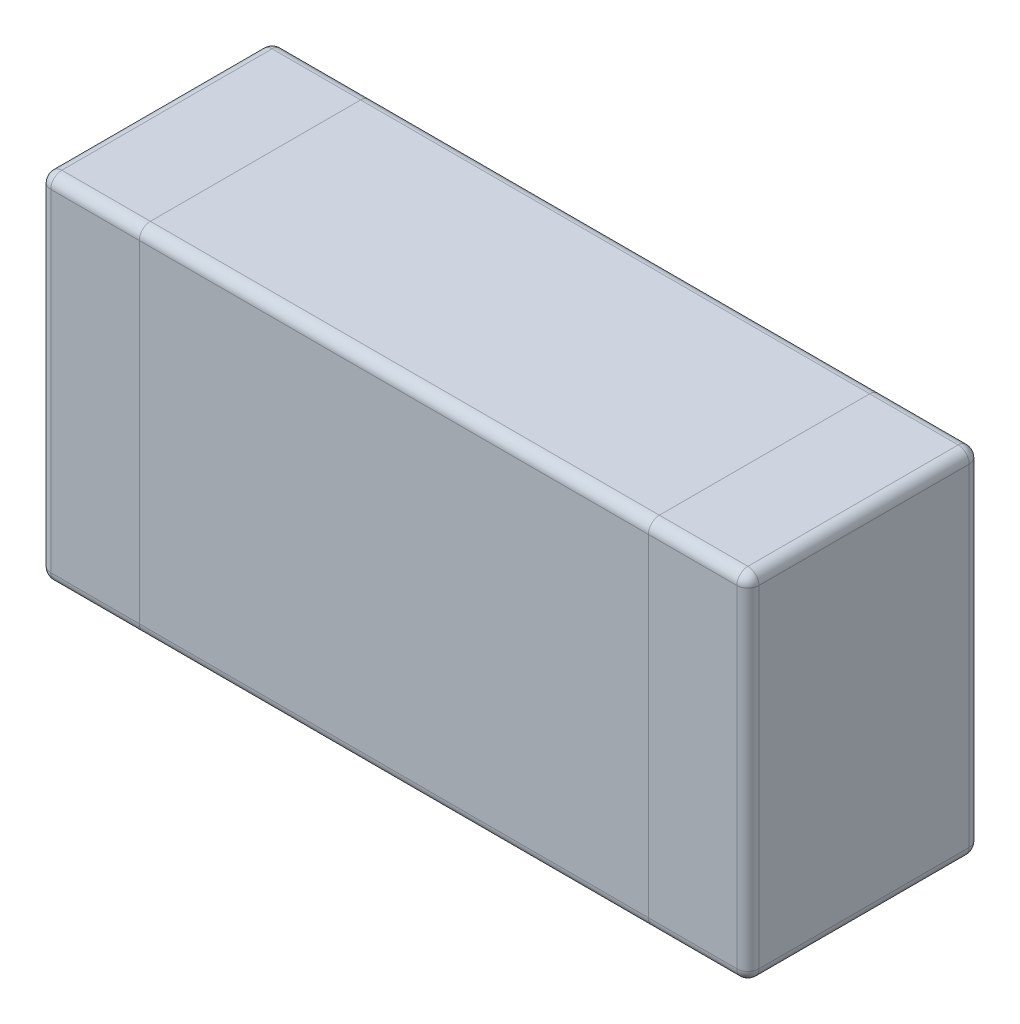
ISO-10303-21;
HEADER;
FILE_DESCRIPTION(('STEP AP214'),'2;1');
FILE_NAME('part.step','',(''),(''),'','','');
FILE_SCHEMA(('AUTOMOTIVE_DESIGN { 1 0 10303 214 1 1 1 1 }'));
ENDSEC;
DATA;
#1=APPLICATION_CONTEXT('core data for automotive mechanical design processes');
#2=APPLICATION_PROTOCOL_DEFINITION('international standard','automotive_design',2000,#1);
#3=PRODUCT_CONTEXT('',#1,'mechanical');
#4=PRODUCT('Part','Part','',(#3));
#5=PRODUCT_RELATED_PRODUCT_CATEGORY('part','',(#4));
#6=PRODUCT_DEFINITION_FORMATION('','',#4);
#7=PRODUCT_DEFINITION_CONTEXT('part definition',#1,'design');
#8=PRODUCT_DEFINITION('design','',#6,#7);
#9=PRODUCT_DEFINITION_SHAPE('','',#8);
#10=(LENGTH_UNIT() NAMED_UNIT(*) SI_UNIT(.MILLI.,.METRE.));
#11=(NAMED_UNIT(*) PLANE_ANGLE_UNIT() SI_UNIT($,.RADIAN.));
#12=(NAMED_UNIT(*) SI_UNIT($,.STERADIAN.) SOLID_ANGLE_UNIT());
#13=UNCERTAINTY_MEASURE_WITH_UNIT(LENGTH_MEASURE(1.E-05),#10,'distance_accuracy_value','');
#14=(GEOMETRIC_REPRESENTATION_CONTEXT(3) GLOBAL_UNCERTAINTY_ASSIGNED_CONTEXT((#13)) GLOBAL_UNIT_ASSIGNED_CONTEXT((#10,
#11,#12)) REPRESENTATION_CONTEXT('',''));
#15=CARTESIAN_POINT('',(0.,0.,0.));
#16=DIRECTION('',(0.,0.,1.));
#17=DIRECTION('',(1.,0.,0.));
#18=AXIS2_PLACEMENT_3D('',#15,#16,#17);
#19=CARTESIAN_POINT('',(1.55,0.749999999999718,1.0500000000002));
#20=DIRECTION('',(0.,2.68882138776405E-13,-1.));
#21=DIRECTION('',(0.,1.,2.68882138776405E-13));
#22=AXIS2_PLACEMENT_3D('',#19,#20,#21);
#23=CYLINDRICAL_SURFACE('',#22,0.05);
#24=CARTESIAN_POINT('',(1.55,0.749999999999731,1.0000000000002));
#25=DIRECTION('',(0.,2.68882138776405E-13,-1.));
#26=DIRECTION('',(0.,-1.,-2.68882138776405E-13));
#27=AXIS2_PLACEMENT_3D('',#24,#25,#26);
#28=CIRCLE('',#27,0.05);
#29=CARTESIAN_POINT('',(1.55,0.799999999999731,1.00000000000021));
#30=VERTEX_POINT('',#29);
#31=CARTESIAN_POINT('',(1.6,0.749999999999731,1.0000000000002));
#32=VERTEX_POINT('',#31);
#33=EDGE_CURVE('E27',#30,#32,#28,.T.);
#34=ORIENTED_EDGE('',*,*,#33,.T.);
#35=DIRECTION('',(0.,-2.68736422004423E-13,1.));
#36=VECTOR('',#35,1.);
#37=CARTESIAN_POINT('',(1.6,0.749999999999718,1.0500000000002));
#38=LINE('',#37,#36);
#39=CARTESIAN_POINT('',(1.6,0.749999999999987,0.0500000000002015));
#40=VERTEX_POINT('',#39);
#41=EDGE_CURVE('E329',#40,#32,#38,.T.);
#42=ORIENTED_EDGE('',*,*,#41,.F.);
#43=CARTESIAN_POINT('',(1.55,0.749999999999987,0.0500000000002015));
#44=DIRECTION('',(0.,-2.68746613504845E-13,1.));
#45=DIRECTION('',(0.,1.,2.68746613504845E-13));
#46=AXIS2_PLACEMENT_3D('',#43,#44,#45);
#47=CIRCLE('',#46,0.05);
#48=CARTESIAN_POINT('',(1.55,0.799999999999987,0.0500000000002149));
#49=VERTEX_POINT('',#48);
#50=EDGE_CURVE('E11',#40,#49,#47,.T.);
#51=ORIENTED_EDGE('',*,*,#50,.T.);
#52=DIRECTION('',(0.,2.68736422004423E-13,-1.));
#53=VECTOR('',#52,1.);
#54=CARTESIAN_POINT('',(1.55,0.799999999999718,1.05000000000021));
#55=LINE('',#54,#53);
#56=EDGE_CURVE('E324',#30,#49,#55,.T.);
#57=ORIENTED_EDGE('',*,*,#56,.F.);
#58=EDGE_LOOP('',(#34,#42,#51,#57));
#59=FACE_BOUND('',#58,.T.);
#60=ADVANCED_FACE('F17',(#59),#23,.T.);
#61=CARTESIAN_POINT('',(1.55,0.749999999999987,0.0500000000002016));
#62=DIRECTION('',(0.,-2.68736422004423E-13,1.));
#63=DIRECTION('',(1.,0.,0.));
#64=AXIS2_PLACEMENT_3D('',#61,#62,#63);
#65=SPHERICAL_SURFACE('',#64,0.05);
#66=CARTESIAN_POINT('',(1.55,0.749999999999987,0.0500000000002015));
#67=DIRECTION('',(0.,1.,2.68736422004423E-13));
#68=DIRECTION('',(-1.,0.,0.));
#69=AXIS2_PLACEMENT_3D('',#66,#67,#68);
#70=CIRCLE('',#69,0.05);
#71=CARTESIAN_POINT('',(1.55,0.75,2.01552316503317E-13));
#72=VERTEX_POINT('',#71);
#73=EDGE_CURVE('E254',#40,#72,#70,.T.);
#74=ORIENTED_EDGE('',*,*,#73,.T.);
#75=CARTESIAN_POINT('',(1.55,0.749999999999987,0.0500000000002016));
#76=DIRECTION('',(1.,0.,0.));
#77=DIRECTION('',(0.,1.,2.68746613504845E-13));
#78=AXIS2_PLACEMENT_3D('',#75,#76,#77);
#79=CIRCLE('',#78,0.05);
#80=EDGE_CURVE('E309',#72,#49,#79,.T.);
#81=ORIENTED_EDGE('',*,*,#80,.T.);
#82=ORIENTED_EDGE('',*,*,#50,.F.);
#83=EDGE_LOOP('',(#74,#81,#82));
#84=FACE_BOUND('',#83,.T.);
#85=ADVANCED_FACE('F770',(#84),#65,.T.);
#86=CARTESIAN_POINT('',(1.55,0.749999999999731,1.0000000000002));
#87=DIRECTION('',(0.,-2.68736422004423E-13,1.));
#88=DIRECTION('',(1.,0.,0.));
#89=AXIS2_PLACEMENT_3D('',#86,#87,#88);
#90=SPHERICAL_SURFACE('',#89,0.05);
#91=CARTESIAN_POINT('',(1.55,0.749999999999731,1.0000000000002));
#92=DIRECTION('',(1.,0.,0.));
#93=DIRECTION('',(0.,-2.68882138776406E-13,1.));
#94=AXIS2_PLACEMENT_3D('',#91,#92,#93);
#95=CIRCLE('',#94,0.05);
#96=CARTESIAN_POINT('',(1.55,0.749999999999718,1.0500000000002));
#97=VERTEX_POINT('',#96);
#98=EDGE_CURVE('E294',#30,#97,#95,.T.);
#99=ORIENTED_EDGE('',*,*,#98,.T.);
#100=CARTESIAN_POINT('',(1.55,0.749999999999731,1.0000000000002));
#101=DIRECTION('',(0.,1.,2.68736422004423E-13));
#102=DIRECTION('',(-1.,0.,0.));
#103=AXIS2_PLACEMENT_3D('',#100,#101,#102);
#104=CIRCLE('',#103,0.05);
#105=EDGE_CURVE('E20',#97,#32,#104,.T.);
#106=ORIENTED_EDGE('',*,*,#105,.T.);
#107=ORIENTED_EDGE('',*,*,#33,.F.);
#108=EDGE_LOOP('',(#99,#106,#107));
#109=FACE_BOUND('',#108,.T.);
#110=ADVANCED_FACE('F775',(#109),#90,.T.);
#111=CARTESIAN_POINT('',(1.55,-0.800000000000014,0.0499999999997849));
#112=DIRECTION('',(0.,-1.,-2.68736422004423E-13));
#113=DIRECTION('',(1.,0.,0.));
#114=AXIS2_PLACEMENT_3D('',#111,#112,#113);
#115=CYLINDRICAL_SURFACE('',#114,0.05);
#116=CARTESIAN_POINT('',(1.55,-0.750000000000014,0.0499999999997985));
#117=DIRECTION('',(0.,1.,2.68736422004423E-13));
#118=DIRECTION('',(1.,0.,0.));
#119=AXIS2_PLACEMENT_3D('',#116,#117,#118);
#120=CIRCLE('',#119,0.05);
#121=CARTESIAN_POINT('',(1.6,-0.750000000000014,0.0499999999997984));
#122=VERTEX_POINT('',#121);
#123=CARTESIAN_POINT('',(1.55,-0.75,-2.01552316503317E-13));
#124=VERTEX_POINT('',#123);
#125=EDGE_CURVE('E173',#122,#124,#120,.T.);
#126=ORIENTED_EDGE('',*,*,#125,.T.);
#127=DIRECTION('',(0.,-1.,-2.68736422004423E-13));
#128=VECTOR('',#127,1.);
#129=CARTESIAN_POINT('',(1.55,-0.8,-2.14989137603538E-13));
#130=LINE('',#129,#128);
#131=EDGE_CURVE('E285',#72,#124,#130,.T.);
#132=ORIENTED_EDGE('',*,*,#131,.F.);
#133=ORIENTED_EDGE('',*,*,#73,.F.);
#134=DIRECTION('',(0.,1.,2.68736422004423E-13));
#135=VECTOR('',#134,1.);
#136=CARTESIAN_POINT('',(1.6,0.799999999999987,0.0500000000002149));
#137=LINE('',#136,#135);
#138=EDGE_CURVE('E334',#122,#40,#137,.T.);
#139=ORIENTED_EDGE('',*,*,#138,.F.);
#140=EDGE_LOOP('',(#126,#132,#133,#139));
#141=FACE_BOUND('',#140,.T.);
#142=ADVANCED_FACE('F779',(#141),#115,.T.);
#143=CARTESIAN_POINT('',(-1.6,0.749999999999987,0.0500000000002015));
#144=DIRECTION('',(1.,0.,0.));
#145=DIRECTION('',(0.,1.,2.68746613504845E-13));
#146=AXIS2_PLACEMENT_3D('',#143,#144,#145);
#147=CYLINDRICAL_SURFACE('',#146,0.05);
#148=CARTESIAN_POINT('',(-1.15,0.749999999999987,0.0500000000002015));
#149=DIRECTION('',(-1.,0.,0.));
#150=DIRECTION('',(0.,1.,2.68746613504845E-13));
#151=AXIS2_PLACEMENT_3D('',#148,#149,#150);
#152=CIRCLE('',#151,0.05);
#153=CARTESIAN_POINT('',(-1.15,0.799999999999987,0.0500000000002149));
#154=VERTEX_POINT('',#153);
#155=CARTESIAN_POINT('',(-1.15,0.75,2.01552316503317E-13));
#156=VERTEX_POINT('',#155);
#157=EDGE_CURVE('E302',#154,#156,#152,.T.);
#158=ORIENTED_EDGE('',*,*,#157,.F.);
#159=DIRECTION('',(-1.,0.,0.));
#160=VECTOR('',#159,1.);
#161=CARTESIAN_POINT('',(-1.6,0.799999999999987,0.0500000000002149));
#162=LINE('',#161,#160);
#163=CARTESIAN_POINT('',(1.15,0.799999999999987,0.0500000000002149));
#164=VERTEX_POINT('',#163);
#165=EDGE_CURVE('E130',#164,#154,#162,.T.);
#166=ORIENTED_EDGE('',*,*,#165,.F.);
#167=CARTESIAN_POINT('',(1.15,0.749999999999987,0.0500000000002015));
#168=DIRECTION('',(1.,0.,0.));
#169=DIRECTION('',(0.,-1.,-2.68746613504845E-13));
#170=AXIS2_PLACEMENT_3D('',#167,#168,#169);
#171=CIRCLE('',#170,0.05);
#172=CARTESIAN_POINT('',(1.15,0.75,2.01552316503317E-13));
#173=VERTEX_POINT('',#172);
#174=EDGE_CURVE('E238',#173,#164,#171,.T.);
#175=ORIENTED_EDGE('',*,*,#174,.F.);
#176=DIRECTION('',(1.,0.,0.));
#177=VECTOR('',#176,1.);
#178=CARTESIAN_POINT('',(1.6,0.75,2.01552316503317E-13));
#179=LINE('',#178,#177);
#180=EDGE_CURVE('E155',#156,#173,#179,.T.);
#181=ORIENTED_EDGE('',*,*,#180,.F.);
#182=EDGE_LOOP('',(#158,#166,#175,#181));
#183=FACE_BOUND('',#182,.T.);
#184=ADVANCED_FACE('F526',(#183),#147,.T.);
#185=CARTESIAN_POINT('',(1.6,0.749999999999731,1.0000000000002));
#186=DIRECTION('',(-1.,0.,0.));
#187=DIRECTION('',(0.,-1.,-2.68882138776405E-13));
#188=AXIS2_PLACEMENT_3D('',#185,#186,#187);
#189=CYLINDRICAL_SURFACE('',#188,0.05);
#190=CARTESIAN_POINT('',(-1.15,0.749999999999731,1.0000000000002));
#191=DIRECTION('',(-1.,0.,0.));
#192=DIRECTION('',(0.,1.,2.68882138776405E-13));
#193=AXIS2_PLACEMENT_3D('',#190,#191,#192);
#194=CIRCLE('',#193,0.05);
#195=CARTESIAN_POINT('',(-1.15,0.749999999999718,1.0500000000002));
#196=VERTEX_POINT('',#195);
#197=CARTESIAN_POINT('',(-1.15,0.799999999999731,1.00000000000021));
#198=VERTEX_POINT('',#197);
#199=EDGE_CURVE('E289',#196,#198,#194,.T.);
#200=ORIENTED_EDGE('',*,*,#199,.F.);
#201=DIRECTION('',(-1.,0.,0.));
#202=VECTOR('',#201,1.);
#203=CARTESIAN_POINT('',(1.6,0.749999999999718,1.0500000000002));
#204=LINE('',#203,#202);
#205=CARTESIAN_POINT('',(1.15,0.749999999999718,1.0500000000002));
#206=VERTEX_POINT('',#205);
#207=EDGE_CURVE('E150',#206,#196,#204,.T.);
#208=ORIENTED_EDGE('',*,*,#207,.F.);
#209=CARTESIAN_POINT('',(1.15,0.749999999999731,1.0000000000002));
#210=DIRECTION('',(1.,0.,0.));
#211=DIRECTION('',(0.,-1.,-2.68882138776405E-13));
#212=AXIS2_PLACEMENT_3D('',#209,#210,#211);
#213=CIRCLE('',#212,0.05);
#214=CARTESIAN_POINT('',(1.15,0.799999999999731,1.00000000000021));
#215=VERTEX_POINT('',#214);
#216=EDGE_CURVE('E290',#215,#206,#213,.T.);
#217=ORIENTED_EDGE('',*,*,#216,.F.);
#218=DIRECTION('',(1.,0.,0.));
#219=VECTOR('',#218,1.);
#220=CARTESIAN_POINT('',(-1.6,0.799999999999731,1.00000000000021));
#221=LINE('',#220,#219);
#222=EDGE_CURVE('E123',#198,#215,#221,.T.);
#223=ORIENTED_EDGE('',*,*,#222,.F.);
#224=EDGE_LOOP('',(#200,#208,#217,#223));
#225=FACE_BOUND('',#224,.T.);
#226=ADVANCED_FACE('F786',(#225),#189,.T.);
#227=CARTESIAN_POINT('',(1.55,0.799999999999731,1.00000000000021));
#228=DIRECTION('',(0.,1.,2.68736422004423E-13));
#229=DIRECTION('',(-1.,0.,0.));
#230=AXIS2_PLACEMENT_3D('',#227,#228,#229);
#231=CYLINDRICAL_SURFACE('',#230,0.05);
#232=CARTESIAN_POINT('',(1.55,-0.750000000000269,0.999999999999799));
#233=DIRECTION('',(0.,1.,2.71050543121376E-13));
#234=DIRECTION('',(0.,2.71050543121376E-13,-1.));
#235=AXIS2_PLACEMENT_3D('',#232,#233,#234);
#236=CIRCLE('',#235,0.05);
#237=CARTESIAN_POINT('',(1.55,-0.750000000000283,1.0499999999998));
#238=VERTEX_POINT('',#237);
#239=CARTESIAN_POINT('',(1.6,-0.750000000000269,0.999999999999799));
#240=VERTEX_POINT('',#239);
#241=EDGE_CURVE('E169',#238,#240,#236,.T.);
#242=ORIENTED_EDGE('',*,*,#241,.T.);
#243=DIRECTION('',(0.,-1.,-2.68736422004423E-13));
#244=VECTOR('',#243,1.);
#245=CARTESIAN_POINT('',(1.6,-0.800000000000269,0.999999999999786));
#246=LINE('',#245,#244);
#247=EDGE_CURVE('E330',#32,#240,#246,.T.);
#248=ORIENTED_EDGE('',*,*,#247,.F.);
#249=ORIENTED_EDGE('',*,*,#105,.F.);
#250=DIRECTION('',(0.,1.,2.68736422004423E-13));
#251=VECTOR('',#250,1.);
#252=CARTESIAN_POINT('',(1.55,0.799999999999718,1.05000000000021));
#253=LINE('',#252,#251);
#254=EDGE_CURVE('E371',#238,#97,#253,.T.);
#255=ORIENTED_EDGE('',*,*,#254,.F.);
#256=EDGE_LOOP('',(#242,#248,#249,#255));
#257=FACE_BOUND('',#256,.T.);
#258=ADVANCED_FACE('F570',(#257),#231,.T.);
#259=CARTESIAN_POINT('',(1.55,-0.750000000000014,0.0499999999997985));
#260=DIRECTION('',(0.,-2.68736422004423E-13,1.));
#261=DIRECTION('',(1.,0.,0.));
#262=AXIS2_PLACEMENT_3D('',#259,#260,#261);
#263=SPHERICAL_SURFACE('',#262,0.05);
#264=CARTESIAN_POINT('',(1.55,-0.750000000000014,0.0499999999997984));
#265=DIRECTION('',(0.,2.68746613504845E-13,-1.));
#266=DIRECTION('',(0.,1.,2.68746613504845E-13));
#267=AXIS2_PLACEMENT_3D('',#264,#265,#266);
#268=CIRCLE('',#267,0.05);
#269=CARTESIAN_POINT('',(1.55,-0.800000000000014,0.0499999999997849));
#270=VERTEX_POINT('',#269);
#271=EDGE_CURVE('E174',#122,#270,#268,.T.);
#272=ORIENTED_EDGE('',*,*,#271,.T.);
#273=CARTESIAN_POINT('',(1.55,-0.750000000000014,0.0499999999997984));
#274=DIRECTION('',(1.,0.,0.));
#275=DIRECTION('',(0.,1.,2.68746613504845E-13));
#276=AXIS2_PLACEMENT_3D('',#273,#274,#275);
#277=CIRCLE('',#276,0.05);
#278=EDGE_CURVE('E190',#270,#124,#277,.T.);
#279=ORIENTED_EDGE('',*,*,#278,.T.);
#280=ORIENTED_EDGE('',*,*,#125,.F.);
#281=EDGE_LOOP('',(#272,#279,#280));
#282=FACE_BOUND('',#281,.T.);
#283=ADVANCED_FACE('F188',(#282),#263,.T.);
#284=CARTESIAN_POINT('',(-1.55,0.749999999999987,0.0500000000002016));
#285=DIRECTION('',(0.,-2.68736422004423E-13,1.));
#286=DIRECTION('',(1.,0.,0.));
#287=AXIS2_PLACEMENT_3D('',#284,#285,#286);
#288=SPHERICAL_SURFACE('',#287,0.05);
#289=CARTESIAN_POINT('',(-1.55,0.749999999999987,0.0500000000002016));
#290=DIRECTION('',(0.,1.,2.68736422004423E-13));
#291=DIRECTION('',(-1.,0.,0.));
#292=AXIS2_PLACEMENT_3D('',#289,#290,#291);
#293=CIRCLE('',#292,0.05);
#294=CARTESIAN_POINT('',(-1.55,0.75,2.01552316503317E-13));
#295=VERTEX_POINT('',#294);
#296=CARTESIAN_POINT('',(-1.6,0.749999999999987,0.0500000000002015));
#297=VERTEX_POINT('',#296);
#298=EDGE_CURVE('E41',#295,#297,#293,.T.);
#299=ORIENTED_EDGE('',*,*,#298,.T.);
#300=CARTESIAN_POINT('',(-1.55,0.749999999999987,0.0500000000002015));
#301=DIRECTION('',(0.,2.68746613504845E-13,-1.));
#302=DIRECTION('',(0.,1.,2.68746613504845E-13));
#303=AXIS2_PLACEMENT_3D('',#300,#301,#302);
#304=CIRCLE('',#303,0.05);
#305=CARTESIAN_POINT('',(-1.55,0.799999999999987,0.0500000000002149));
#306=VERTEX_POINT('',#305);
#307=EDGE_CURVE('E134',#297,#306,#304,.T.);
#308=ORIENTED_EDGE('',*,*,#307,.T.);
#309=CARTESIAN_POINT('',(-1.55,0.749999999999987,0.0500000000002015));
#310=DIRECTION('',(1.,0.,0.));
#311=DIRECTION('',(0.,-1.,-2.68746613504845E-13));
#312=AXIS2_PLACEMENT_3D('',#309,#310,#311);
#313=CIRCLE('',#312,0.05);
#314=EDGE_CURVE('E242',#295,#306,#313,.T.);
#315=ORIENTED_EDGE('',*,*,#314,.F.);
#316=EDGE_LOOP('',(#299,#308,#315));
#317=FACE_BOUND('',#316,.T.);
#318=ADVANCED_FACE('F513',(#317),#288,.T.);
#319=CARTESIAN_POINT('',(-1.55,0.749999999999731,1.0000000000002));
#320=DIRECTION('',(0.,-2.68736422004423E-13,1.));
#321=DIRECTION('',(1.,0.,0.));
#322=AXIS2_PLACEMENT_3D('',#319,#320,#321);
#323=SPHERICAL_SURFACE('',#322,0.05);
#324=CARTESIAN_POINT('',(-1.55,0.749999999999731,1.0000000000002));
#325=DIRECTION('',(0.,-2.68882138776405E-13,1.));
#326=DIRECTION('',(0.,-1.,-2.68882138776405E-13));
#327=AXIS2_PLACEMENT_3D('',#324,#325,#326);
#328=CIRCLE('',#327,0.05);
#329=CARTESIAN_POINT('',(-1.55,0.799999999999731,1.00000000000021));
#330=VERTEX_POINT('',#329);
#331=CARTESIAN_POINT('',(-1.6,0.749999999999732,1.0000000000002));
#332=VERTEX_POINT('',#331);
#333=EDGE_CURVE('E136',#330,#332,#328,.T.);
#334=ORIENTED_EDGE('',*,*,#333,.T.);
#335=CARTESIAN_POINT('',(-1.55,0.749999999999732,1.0000000000002));
#336=DIRECTION('',(0.,1.,2.71050543121376E-13));
#337=DIRECTION('',(0.,-2.71050543121376E-13,1.));
#338=AXIS2_PLACEMENT_3D('',#335,#336,#337);
#339=CIRCLE('',#338,0.05);
#340=CARTESIAN_POINT('',(-1.55,0.749999999999718,1.0500000000002));
#341=VERTEX_POINT('',#340);
#342=EDGE_CURVE('E111',#332,#341,#339,.T.);
#343=ORIENTED_EDGE('',*,*,#342,.T.);
#344=CARTESIAN_POINT('',(-1.55,0.749999999999731,1.0000000000002));
#345=DIRECTION('',(1.,0.,0.));
#346=DIRECTION('',(0.,-1.,-2.68882138776405E-13));
#347=AXIS2_PLACEMENT_3D('',#344,#345,#346);
#348=CIRCLE('',#347,0.05);
#349=EDGE_CURVE('E262',#330,#341,#348,.T.);
#350=ORIENTED_EDGE('',*,*,#349,.F.);
#351=EDGE_LOOP('',(#334,#343,#350));
#352=FACE_BOUND('',#351,.T.);
#353=ADVANCED_FACE('F816',(#352),#323,.T.);
#354=CARTESIAN_POINT('',(1.55,-0.750000000000269,0.999999999999799));
#355=DIRECTION('',(0.,-2.68736422004423E-13,1.));
#356=DIRECTION('',(1.,0.,0.));
#357=AXIS2_PLACEMENT_3D('',#354,#355,#356);
#358=SPHERICAL_SURFACE('',#357,0.05);
#359=CARTESIAN_POINT('',(1.55,-0.750000000000269,0.999999999999799));
#360=DIRECTION('',(1.,0.,0.));
#361=DIRECTION('',(0.,1.,2.68882138776405E-13));
#362=AXIS2_PLACEMENT_3D('',#359,#360,#361);
#363=CIRCLE('',#362,0.05);
#364=CARTESIAN_POINT('',(1.55,-0.800000000000269,0.999999999999786));
#365=VERTEX_POINT('',#364);
#366=EDGE_CURVE('E361',#238,#365,#363,.T.);
#367=ORIENTED_EDGE('',*,*,#366,.T.);
#368=CARTESIAN_POINT('',(1.55,-0.750000000000269,0.999999999999799));
#369=DIRECTION('',(0.,-2.68882138776405E-13,1.));
#370=DIRECTION('',(0.,-1.,-2.68882138776405E-13));
#371=AXIS2_PLACEMENT_3D('',#368,#369,#370);
#372=CIRCLE('',#371,0.05);
#373=EDGE_CURVE('E175',#365,#240,#372,.T.);
#374=ORIENTED_EDGE('',*,*,#373,.T.);
#375=ORIENTED_EDGE('',*,*,#241,.F.);
#376=EDGE_LOOP('',(#367,#374,#375));
#377=FACE_BOUND('',#376,.T.);
#378=ADVANCED_FACE('F561',(#377),#358,.T.);
#379=CARTESIAN_POINT('',(1.55,-0.750000000000283,1.0499999999998));
#380=DIRECTION('',(0.,2.68882138776405E-13,-1.));
#381=DIRECTION('',(0.,1.,2.68882138776405E-13));
#382=AXIS2_PLACEMENT_3D('',#379,#380,#381);
#383=CYLINDRICAL_SURFACE('',#382,0.05);
#384=ORIENTED_EDGE('',*,*,#373,.F.);
#385=DIRECTION('',(0.,-2.68736422004423E-13,1.));
#386=VECTOR('',#385,1.);
#387=CARTESIAN_POINT('',(1.55,-0.800000000000282,1.04999999999979));
#388=LINE('',#387,#386);
#389=EDGE_CURVE('E215',#270,#365,#388,.T.);
#390=ORIENTED_EDGE('',*,*,#389,.F.);
#391=ORIENTED_EDGE('',*,*,#271,.F.);
#392=DIRECTION('',(0.,2.68736422004423E-13,-1.));
#393=VECTOR('',#392,1.);
#394=CARTESIAN_POINT('',(1.6,-0.750000000000283,1.0499999999998));
#395=LINE('',#394,#393);
#396=EDGE_CURVE('E333',#240,#122,#395,.T.);
#397=ORIENTED_EDGE('',*,*,#396,.F.);
#398=EDGE_LOOP('',(#384,#390,#391,#397));
#399=FACE_BOUND('',#398,.T.);
#400=ADVANCED_FACE('F216',(#399),#383,.T.);
#401=CARTESIAN_POINT('',(-1.6,-0.750000000000014,0.0499999999997984));
#402=DIRECTION('',(-1.,0.,0.));
#403=DIRECTION('',(0.,-1.,-2.68746613504845E-13));
#404=AXIS2_PLACEMENT_3D('',#401,#402,#403);
#405=CYLINDRICAL_SURFACE('',#404,0.05);
#406=CARTESIAN_POINT('',(-1.15,-0.750000000000014,0.0499999999997984));
#407=DIRECTION('',(-1.,0.,0.));
#408=DIRECTION('',(0.,1.,2.68746613504845E-13));
#409=AXIS2_PLACEMENT_3D('',#406,#407,#408);
#410=CIRCLE('',#409,0.05);
#411=CARTESIAN_POINT('',(-1.15,-0.75,-2.01552316503317E-13));
#412=VERTEX_POINT('',#411);
#413=CARTESIAN_POINT('',(-1.15,-0.800000000000014,0.0499999999997849));
#414=VERTEX_POINT('',#413);
#415=EDGE_CURVE('E236',#412,#414,#410,.T.);
#416=ORIENTED_EDGE('',*,*,#415,.F.);
#417=DIRECTION('',(-1.,0.,0.));
#418=VECTOR('',#417,1.);
#419=CARTESIAN_POINT('',(-1.6,-0.75,-2.01552316503317E-13));
#420=LINE('',#419,#418);
#421=CARTESIAN_POINT('',(1.15,-0.75,-2.01552316503317E-13));
#422=VERTEX_POINT('',#421);
#423=EDGE_CURVE('E104',#422,#412,#420,.T.);
#424=ORIENTED_EDGE('',*,*,#423,.F.);
#425=CARTESIAN_POINT('',(1.15,-0.750000000000014,0.0499999999997984));
#426=DIRECTION('',(1.,0.,0.));
#427=DIRECTION('',(0.,-1.,-2.68746613504845E-13));
#428=AXIS2_PLACEMENT_3D('',#425,#426,#427);
#429=CIRCLE('',#428,0.05);
#430=CARTESIAN_POINT('',(1.15,-0.800000000000014,0.0499999999997849));
#431=VERTEX_POINT('',#430);
#432=EDGE_CURVE('E259',#431,#422,#429,.T.);
#433=ORIENTED_EDGE('',*,*,#432,.F.);
#434=DIRECTION('',(1.,0.,0.));
#435=VECTOR('',#434,1.);
#436=CARTESIAN_POINT('',(1.6,-0.800000000000014,0.0499999999997849));
#437=LINE('',#436,#435);
#438=EDGE_CURVE('E146',#414,#431,#437,.T.);
#439=ORIENTED_EDGE('',*,*,#438,.F.);
#440=EDGE_LOOP('',(#416,#424,#433,#439));
#441=FACE_BOUND('',#440,.T.);
#442=ADVANCED_FACE('F839',(#441),#405,.T.);
#443=CARTESIAN_POINT('',(-1.55,-0.800000000000014,0.0499999999997849));
#444=DIRECTION('',(0.,1.,2.68736422004423E-13));
#445=DIRECTION('',(-1.,0.,0.));
#446=AXIS2_PLACEMENT_3D('',#443,#444,#445);
#447=CYLINDRICAL_SURFACE('',#446,0.05);
#448=CARTESIAN_POINT('',(-1.55,-0.750000000000014,0.0499999999997984));
#449=DIRECTION('',(0.,1.,2.68736422004423E-13));
#450=DIRECTION('',(1.,0.,0.));
#451=AXIS2_PLACEMENT_3D('',#448,#449,#450);
#452=CIRCLE('',#451,0.05);
#453=CARTESIAN_POINT('',(-1.55,-0.75,-2.01552316503317E-13));
#454=VERTEX_POINT('',#453);
#455=CARTESIAN_POINT('',(-1.6,-0.750000000000014,0.0499999999997984));
#456=VERTEX_POINT('',#455);
#457=EDGE_CURVE('E92',#454,#456,#452,.T.);
#458=ORIENTED_EDGE('',*,*,#457,.T.);
#459=DIRECTION('',(0.,-1.,-2.68736422004423E-13));
#460=VECTOR('',#459,1.);
#461=CARTESIAN_POINT('',(-1.6,-0.800000000000014,0.0499999999997849));
#462=LINE('',#461,#460);
#463=EDGE_CURVE('E121',#297,#456,#462,.T.);
#464=ORIENTED_EDGE('',*,*,#463,.F.);
#465=ORIENTED_EDGE('',*,*,#298,.F.);
#466=DIRECTION('',(0.,1.,2.68736422004423E-13));
#467=VECTOR('',#466,1.);
#468=CARTESIAN_POINT('',(-1.55,0.8,2.14989137603538E-13));
#469=LINE('',#468,#467);
#470=EDGE_CURVE('E248',#454,#295,#469,.T.);
#471=ORIENTED_EDGE('',*,*,#470,.F.);
#472=EDGE_LOOP('',(#458,#464,#465,#471));
#473=FACE_BOUND('',#472,.T.);
#474=ADVANCED_FACE('F532',(#473),#447,.T.);
#475=CARTESIAN_POINT('',(-1.55,0.749999999999718,1.0500000000002));
#476=DIRECTION('',(0.,2.68882138776405E-13,-1.));
#477=DIRECTION('',(0.,1.,2.68882138776405E-13));
#478=AXIS2_PLACEMENT_3D('',#475,#476,#477);
#479=CYLINDRICAL_SURFACE('',#478,0.05);
#480=ORIENTED_EDGE('',*,*,#307,.F.);
#481=DIRECTION('',(0.,2.68736422004423E-13,-1.));
#482=VECTOR('',#481,1.);
#483=CARTESIAN_POINT('',(-1.6,0.749999999999718,1.0500000000002));
#484=LINE('',#483,#482);
#485=EDGE_CURVE('E116',#332,#297,#484,.T.);
#486=ORIENTED_EDGE('',*,*,#485,.F.);
#487=ORIENTED_EDGE('',*,*,#333,.F.);
#488=DIRECTION('',(0.,-2.68736422004423E-13,1.));
#489=VECTOR('',#488,1.);
#490=CARTESIAN_POINT('',(-1.55,0.799999999999718,1.05000000000021));
#491=LINE('',#490,#489);
#492=EDGE_CURVE('E314',#306,#330,#491,.T.);
#493=ORIENTED_EDGE('',*,*,#492,.F.);
#494=EDGE_LOOP('',(#480,#486,#487,#493));
#495=FACE_BOUND('',#494,.T.);
#496=ADVANCED_FACE('F515',(#495),#479,.T.);
#497=CARTESIAN_POINT('',(-1.55,0.799999999999731,1.00000000000021));
#498=DIRECTION('',(0.,-1.,-2.68736422004423E-13));
#499=DIRECTION('',(1.,0.,0.));
#500=AXIS2_PLACEMENT_3D('',#497,#498,#499);
#501=CYLINDRICAL_SURFACE('',#500,0.05);
#502=CARTESIAN_POINT('',(-1.55,-0.750000000000269,0.999999999999799));
#503=DIRECTION('',(0.,1.,2.68736422004423E-13));
#504=DIRECTION('',(1.,0.,0.));
#505=AXIS2_PLACEMENT_3D('',#502,#503,#504);
#506=CIRCLE('',#505,0.05);
#507=CARTESIAN_POINT('',(-1.6,-0.750000000000269,0.999999999999799));
#508=VERTEX_POINT('',#507);
#509=CARTESIAN_POINT('',(-1.55,-0.750000000000283,1.0499999999998));
#510=VERTEX_POINT('',#509);
#511=EDGE_CURVE('E78',#508,#510,#506,.T.);
#512=ORIENTED_EDGE('',*,*,#511,.T.);
#513=DIRECTION('',(0.,-1.,-2.68736422004423E-13));
#514=VECTOR('',#513,1.);
#515=CARTESIAN_POINT('',(-1.55,0.799999999999718,1.05000000000021));
#516=LINE('',#515,#514);
#517=EDGE_CURVE('E372',#341,#510,#516,.T.);
#518=ORIENTED_EDGE('',*,*,#517,.F.);
#519=ORIENTED_EDGE('',*,*,#342,.F.);
#520=DIRECTION('',(0.,1.,2.68736422004423E-13));
#521=VECTOR('',#520,1.);
#522=CARTESIAN_POINT('',(-1.6,-0.800000000000269,0.999999999999786));
#523=LINE('',#522,#521);
#524=EDGE_CURVE('E108',#508,#332,#523,.T.);
#525=ORIENTED_EDGE('',*,*,#524,.F.);
#526=EDGE_LOOP('',(#512,#518,#519,#525));
#527=FACE_BOUND('',#526,.T.);
#528=ADVANCED_FACE('F109',(#527),#501,.T.);
#529=CARTESIAN_POINT('',(1.6,-0.750000000000269,0.999999999999799));
#530=DIRECTION('',(1.,0.,0.));
#531=DIRECTION('',(0.,1.,2.68882138776405E-13));
#532=AXIS2_PLACEMENT_3D('',#529,#530,#531);
#533=CYLINDRICAL_SURFACE('',#532,0.05);
#534=CARTESIAN_POINT('',(-1.15,-0.750000000000269,0.999999999999799));
#535=DIRECTION('',(-1.,0.,0.));
#536=DIRECTION('',(0.,1.,2.68882138776405E-13));
#537=AXIS2_PLACEMENT_3D('',#534,#535,#536);
#538=CIRCLE('',#537,0.05);
#539=CARTESIAN_POINT('',(-1.15,-0.800000000000269,0.999999999999786));
#540=VERTEX_POINT('',#539);
#541=CARTESIAN_POINT('',(-1.15,-0.750000000000283,1.0499999999998));
#542=VERTEX_POINT('',#541);
#543=EDGE_CURVE('E384',#540,#542,#538,.T.);
#544=ORIENTED_EDGE('',*,*,#543,.F.);
#545=DIRECTION('',(-1.,0.,0.));
#546=VECTOR('',#545,1.);
#547=CARTESIAN_POINT('',(-1.6,-0.800000000000269,0.999999999999786));
#548=LINE('',#547,#546);
#549=CARTESIAN_POINT('',(1.15,-0.800000000000269,0.999999999999786));
#550=VERTEX_POINT('',#549);
#551=EDGE_CURVE('E142',#550,#540,#548,.T.);
#552=ORIENTED_EDGE('',*,*,#551,.F.);
#553=CARTESIAN_POINT('',(1.15,-0.750000000000269,0.999999999999799));
#554=DIRECTION('',(1.,0.,0.));
#555=DIRECTION('',(0.,-1.,-2.68882138776405E-13));
#556=AXIS2_PLACEMENT_3D('',#553,#554,#555);
#557=CIRCLE('',#556,0.05);
#558=CARTESIAN_POINT('',(1.15,-0.750000000000283,1.0499999999998));
#559=VERTEX_POINT('',#558);
#560=EDGE_CURVE('E362',#559,#550,#557,.T.);
#561=ORIENTED_EDGE('',*,*,#560,.F.);
#562=DIRECTION('',(1.,0.,0.));
#563=VECTOR('',#562,1.);
#564=CARTESIAN_POINT('',(1.6,-0.750000000000283,1.0499999999998));
#565=LINE('',#564,#563);
#566=EDGE_CURVE('E151',#542,#559,#565,.T.);
#567=ORIENTED_EDGE('',*,*,#566,.F.);
#568=EDGE_LOOP('',(#544,#552,#561,#567));
#569=FACE_BOUND('',#568,.T.);
#570=ADVANCED_FACE('F585',(#569),#533,.T.);
#571=CARTESIAN_POINT('',(-1.55,-0.750000000000014,0.0499999999997985));
#572=DIRECTION('',(0.,-2.68736422004423E-13,1.));
#573=DIRECTION('',(1.,0.,0.));
#574=AXIS2_PLACEMENT_3D('',#571,#572,#573);
#575=SPHERICAL_SURFACE('',#574,0.05);
#576=CARTESIAN_POINT('',(-1.55,-0.750000000000014,0.0499999999997985));
#577=DIRECTION('',(1.,0.,0.));
#578=DIRECTION('',(0.,-1.,-2.70508442035133E-13));
#579=AXIS2_PLACEMENT_3D('',#576,#577,#578);
#580=CIRCLE('',#579,0.05);
#581=CARTESIAN_POINT('',(-1.55,-0.800000000000014,0.0499999999997849));
#582=VERTEX_POINT('',#581);
#583=EDGE_CURVE('E255',#582,#454,#580,.T.);
#584=ORIENTED_EDGE('',*,*,#583,.F.);
#585=CARTESIAN_POINT('',(-1.55,-0.750000000000014,0.0499999999997984));
#586=DIRECTION('',(0.,2.68746613504845E-13,-1.));
#587=DIRECTION('',(0.,1.,2.68746613504845E-13));
#588=AXIS2_PLACEMENT_3D('',#585,#586,#587);
#589=CIRCLE('',#588,0.05);
#590=EDGE_CURVE('E93',#582,#456,#589,.T.);
#591=ORIENTED_EDGE('',*,*,#590,.T.);
#592=ORIENTED_EDGE('',*,*,#457,.F.);
#593=EDGE_LOOP('',(#584,#591,#592));
#594=FACE_BOUND('',#593,.T.);
#595=ADVANCED_FACE('F539',(#594),#575,.T.);
#596=CARTESIAN_POINT('',(-1.55,-0.750000000000269,0.999999999999799));
#597=DIRECTION('',(0.,-2.68736422004423E-13,1.));
#598=DIRECTION('',(1.,0.,0.));
#599=AXIS2_PLACEMENT_3D('',#596,#597,#598);
#600=SPHERICAL_SURFACE('',#599,0.05);
#601=ORIENTED_EDGE('',*,*,#511,.F.);
#602=CARTESIAN_POINT('',(-1.55,-0.750000000000269,0.999999999999799));
#603=DIRECTION('',(0.,-2.68882138776405E-13,1.));
#604=DIRECTION('',(0.,-1.,-2.68882138776405E-13));
#605=AXIS2_PLACEMENT_3D('',#602,#603,#604);
#606=CIRCLE('',#605,0.05);
#607=CARTESIAN_POINT('',(-1.55,-0.800000000000269,0.999999999999786));
#608=VERTEX_POINT('',#607);
#609=EDGE_CURVE('E82',#508,#608,#606,.T.);
#610=ORIENTED_EDGE('',*,*,#609,.T.);
#611=CARTESIAN_POINT('',(-1.55,-0.750000000000269,0.999999999999799));
#612=DIRECTION('',(1.,0.,0.));
#613=DIRECTION('',(0.,2.68882138776405E-13,-1.));
#614=AXIS2_PLACEMENT_3D('',#611,#612,#613);
#615=CIRCLE('',#614,0.05);
#616=EDGE_CURVE('E86',#510,#608,#615,.T.);
#617=ORIENTED_EDGE('',*,*,#616,.F.);
#618=EDGE_LOOP('',(#601,#610,#617));
#619=FACE_BOUND('',#618,.T.);
#620=ADVANCED_FACE('F80',(#619),#600,.T.);
#621=CARTESIAN_POINT('',(-1.55,-0.750000000000283,1.0499999999998));
#622=DIRECTION('',(0.,2.68882138776405E-13,-1.));
#623=DIRECTION('',(0.,1.,2.68882138776405E-13));
#624=AXIS2_PLACEMENT_3D('',#621,#622,#623);
#625=CYLINDRICAL_SURFACE('',#624,0.05);
#626=ORIENTED_EDGE('',*,*,#609,.F.);
#627=DIRECTION('',(0.,-2.68736422004423E-13,1.));
#628=VECTOR('',#627,1.);
#629=CARTESIAN_POINT('',(-1.6,-0.750000000000283,1.0499999999998));
#630=LINE('',#629,#628);
#631=EDGE_CURVE('E100',#456,#508,#630,.T.);
#632=ORIENTED_EDGE('',*,*,#631,.F.);
#633=ORIENTED_EDGE('',*,*,#590,.F.);
#634=DIRECTION('',(0.,2.68736422004423E-13,-1.));
#635=VECTOR('',#634,1.);
#636=CARTESIAN_POINT('',(-1.55,-0.800000000000282,1.04999999999979));
#637=LINE('',#636,#635);
#638=EDGE_CURVE('E102',#608,#582,#637,.T.);
#639=ORIENTED_EDGE('',*,*,#638,.F.);
#640=EDGE_LOOP('',(#626,#632,#633,#639));
#641=FACE_BOUND('',#640,.T.);
#642=ADVANCED_FACE('F97',(#641),#625,.T.);
#643=CARTESIAN_POINT('',(1.6,0.8,2.14989137603538E-13));
#644=DIRECTION('',(0.,2.68736422004423E-13,-1.));
#645=DIRECTION('',(-1.,0.,0.));
#646=AXIS2_PLACEMENT_3D('',#643,#644,#645);
#647=PLANE('',#646);
#648=DIRECTION('',(0.,-1.,-2.68736422004423E-13));
#649=VECTOR('',#648,1.);
#650=CARTESIAN_POINT('',(-1.15,0.8,2.14989137603538E-13));
#651=LINE('',#650,#649);
#652=EDGE_CURVE('E244',#156,#412,#651,.T.);
#653=ORIENTED_EDGE('',*,*,#652,.F.);
#654=ORIENTED_EDGE('',*,*,#180,.T.);
#655=DIRECTION('',(0.,1.,2.68736422004423E-13));
#656=VECTOR('',#655,1.);
#657=CARTESIAN_POINT('',(1.15,0.8,2.14989137603538E-13));
#658=LINE('',#657,#656);
#659=EDGE_CURVE('E280',#422,#173,#658,.T.);
#660=ORIENTED_EDGE('',*,*,#659,.F.);
#661=ORIENTED_EDGE('',*,*,#423,.T.);
#662=EDGE_LOOP('',(#653,#654,#660,#661));
#663=FACE_BOUND('',#662,.T.);
#664=ADVANCED_FACE('F443',(#663),#647,.T.);
#665=CARTESIAN_POINT('',(1.6,0.799999999999718,1.05000000000021));
#666=DIRECTION('',(0.,2.68736422004423E-13,-1.));
#667=DIRECTION('',(-1.,0.,0.));
#668=AXIS2_PLACEMENT_3D('',#665,#666,#667);
#669=PLANE('',#668);
#670=ORIENTED_EDGE('',*,*,#207,.T.);
#671=DIRECTION('',(0.,-1.,-2.68736422004423E-13));
#672=VECTOR('',#671,1.);
#673=CARTESIAN_POINT('',(-1.15,0.799999999999718,1.05000000000021));
#674=LINE('',#673,#672);
#675=EDGE_CURVE('E354',#196,#542,#674,.T.);
#676=ORIENTED_EDGE('',*,*,#675,.T.);
#677=ORIENTED_EDGE('',*,*,#566,.T.);
#678=DIRECTION('',(0.,1.,2.68736422004423E-13));
#679=VECTOR('',#678,1.);
#680=CARTESIAN_POINT('',(1.15,0.799999999999718,1.05000000000021));
#681=LINE('',#680,#679);
#682=EDGE_CURVE('E380',#559,#206,#681,.T.);
#683=ORIENTED_EDGE('',*,*,#682,.T.);
#684=EDGE_LOOP('',(#670,#676,#677,#683));
#685=FACE_BOUND('',#684,.T.);
#686=ADVANCED_FACE('F575',(#685),#669,.F.);
#687=CARTESIAN_POINT('',(-1.6,-0.800000000000282,1.04999999999979));
#688=DIRECTION('',(0.,1.,2.68736422004423E-13));
#689=DIRECTION('',(0.,2.68736422004423E-13,-1.));
#690=AXIS2_PLACEMENT_3D('',#687,#688,#689);
#691=PLANE('',#690);
#692=ORIENTED_EDGE('',*,*,#551,.T.);
#693=DIRECTION('',(0.,2.68736422004423E-13,-1.));
#694=VECTOR('',#693,1.);
#695=CARTESIAN_POINT('',(-1.15,-0.800000000000282,1.04999999999979));
#696=LINE('',#695,#694);
#697=EDGE_CURVE('E394',#540,#414,#696,.T.);
#698=ORIENTED_EDGE('',*,*,#697,.T.);
#699=ORIENTED_EDGE('',*,*,#438,.T.);
#700=DIRECTION('',(0.,-2.68736422004423E-13,1.));
#701=VECTOR('',#700,1.);
#702=CARTESIAN_POINT('',(1.15,-0.800000000000282,1.04999999999979));
#703=LINE('',#702,#701);
#704=EDGE_CURVE('E226',#431,#550,#703,.T.);
#705=ORIENTED_EDGE('',*,*,#704,.T.);
#706=EDGE_LOOP('',(#692,#698,#699,#705));
#707=FACE_BOUND('',#706,.T.);
#708=ADVANCED_FACE('F911',(#707),#691,.F.);
#709=CARTESIAN_POINT('',(-1.6,-0.800000000000282,1.04999999999979));
#710=DIRECTION('',(1.,0.,0.));
#711=DIRECTION('',(0.,1.,0.));
#712=AXIS2_PLACEMENT_3D('',#709,#710,#711);
#713=PLANE('',#712);
#714=ORIENTED_EDGE('',*,*,#631,.T.);
#715=ORIENTED_EDGE('',*,*,#524,.T.);
#716=ORIENTED_EDGE('',*,*,#485,.T.);
#717=ORIENTED_EDGE('',*,*,#463,.T.);
#718=EDGE_LOOP('',(#714,#715,#716,#717));
#719=FACE_BOUND('',#718,.T.);
#720=ADVANCED_FACE('F119',(#719),#713,.F.);
#721=CARTESIAN_POINT('',(-1.6,0.799999999999718,1.05000000000021));
#722=DIRECTION('',(0.,-1.,-2.68736422004423E-13));
#723=DIRECTION('',(0.,2.68736422004423E-13,-1.));
#724=AXIS2_PLACEMENT_3D('',#721,#722,#723);
#725=PLANE('',#724);
#726=ORIENTED_EDGE('',*,*,#165,.T.);
#727=DIRECTION('',(0.,-2.68736422004423E-13,1.));
#728=VECTOR('',#727,1.);
#729=CARTESIAN_POINT('',(-1.15,0.799999999999718,1.05000000000021));
#730=LINE('',#729,#728);
#731=EDGE_CURVE('E310',#154,#198,#730,.T.);
#732=ORIENTED_EDGE('',*,*,#731,.T.);
#733=ORIENTED_EDGE('',*,*,#222,.T.);
#734=DIRECTION('',(0.,2.68736422004423E-13,-1.));
#735=VECTOR('',#734,1.);
#736=CARTESIAN_POINT('',(1.15,0.799999999999718,1.05000000000021));
#737=LINE('',#736,#735);
#738=EDGE_CURVE('E318',#215,#164,#737,.T.);
#739=ORIENTED_EDGE('',*,*,#738,.T.);
#740=EDGE_LOOP('',(#726,#732,#733,#739));
#741=FACE_BOUND('',#740,.T.);
#742=ADVANCED_FACE('F927',(#741),#725,.F.);
#743=CARTESIAN_POINT('',(1.6,-0.800000000000282,1.04999999999979));
#744=DIRECTION('',(-1.,0.,0.));
#745=DIRECTION('',(0.,0.,1.));
#746=AXIS2_PLACEMENT_3D('',#743,#744,#745);
#747=PLANE('',#746);
#748=ORIENTED_EDGE('',*,*,#41,.T.);
#749=ORIENTED_EDGE('',*,*,#247,.T.);
#750=ORIENTED_EDGE('',*,*,#396,.T.);
#751=ORIENTED_EDGE('',*,*,#138,.T.);
#752=EDGE_LOOP('',(#748,#749,#750,#751));
#753=FACE_BOUND('',#752,.T.);
#754=ADVANCED_FACE('F935',(#753),#747,.F.);
#755=CARTESIAN_POINT('',(-1.6,0.799999999999718,1.05000000000021));
#756=DIRECTION('',(0.,-1.,-2.68736422004423E-13));
#757=DIRECTION('',(0.,2.68736422004423E-13,-1.));
#758=AXIS2_PLACEMENT_3D('',#755,#756,#757);
#759=PLANE('',#758);
#760=ORIENTED_EDGE('',*,*,#738,.F.);
#761=DIRECTION('',(1.,0.,0.));
#762=VECTOR('',#761,1.);
#763=CARTESIAN_POINT('',(-1.6,0.799999999999731,1.00000000000021));
#764=LINE('',#763,#762);
#765=EDGE_CURVE('E266',#215,#30,#764,.T.);
#766=ORIENTED_EDGE('',*,*,#765,.T.);
#767=ORIENTED_EDGE('',*,*,#56,.T.);
#768=DIRECTION('',(-1.,0.,0.));
#769=VECTOR('',#768,1.);
#770=CARTESIAN_POINT('',(-1.6,0.799999999999987,0.0500000000002149));
#771=LINE('',#770,#769);
#772=EDGE_CURVE('E241',#49,#164,#771,.T.);
#773=ORIENTED_EDGE('',*,*,#772,.T.);
#774=EDGE_LOOP('',(#760,#766,#767,#773));
#775=FACE_BOUND('',#774,.T.);
#776=ADVANCED_FACE('F943',(#775),#759,.F.);
#777=CARTESIAN_POINT('',(-1.6,0.799999999999718,1.05000000000021));
#778=DIRECTION('',(0.,-1.,-2.68736422004423E-13));
#779=DIRECTION('',(0.,2.68736422004423E-13,-1.));
#780=AXIS2_PLACEMENT_3D('',#777,#778,#779);
#781=PLANE('',#780);
#782=ORIENTED_EDGE('',*,*,#731,.F.);
#783=DIRECTION('',(-1.,0.,0.));
#784=VECTOR('',#783,1.);
#785=CARTESIAN_POINT('',(-1.6,0.799999999999987,0.0500000000002149));
#786=LINE('',#785,#784);
#787=EDGE_CURVE('E298',#154,#306,#786,.T.);
#788=ORIENTED_EDGE('',*,*,#787,.T.);
#789=ORIENTED_EDGE('',*,*,#492,.T.);
#790=DIRECTION('',(1.,0.,0.));
#791=VECTOR('',#790,1.);
#792=CARTESIAN_POINT('',(-1.6,0.799999999999731,1.00000000000021));
#793=LINE('',#792,#791);
#794=EDGE_CURVE('E267',#330,#198,#793,.T.);
#795=ORIENTED_EDGE('',*,*,#794,.T.);
#796=EDGE_LOOP('',(#782,#788,#789,#795));
#797=FACE_BOUND('',#796,.T.);
#798=ADVANCED_FACE('F522',(#797),#781,.F.);
#799=CARTESIAN_POINT('',(-1.6,0.749999999999987,0.0500000000002015));
#800=DIRECTION('',(1.,0.,0.));
#801=DIRECTION('',(0.,1.,2.68746613504845E-13));
#802=AXIS2_PLACEMENT_3D('',#799,#800,#801);
#803=CYLINDRICAL_SURFACE('',#802,0.05);
#804=DIRECTION('',(1.,0.,0.));
#805=VECTOR('',#804,1.);
#806=CARTESIAN_POINT('',(1.6,0.75,2.01552316503317E-13));
#807=LINE('',#806,#805);
#808=EDGE_CURVE('E281',#173,#72,#807,.T.);
#809=ORIENTED_EDGE('',*,*,#808,.F.);
#810=ORIENTED_EDGE('',*,*,#174,.T.);
#811=ORIENTED_EDGE('',*,*,#772,.F.);
#812=ORIENTED_EDGE('',*,*,#80,.F.);
#813=EDGE_LOOP('',(#809,#810,#811,#812));
#814=FACE_BOUND('',#813,.T.);
#815=ADVANCED_FACE('F1003',(#814),#803,.T.);
#816=CARTESIAN_POINT('',(-1.6,0.749999999999987,0.0500000000002015));
#817=DIRECTION('',(1.,0.,0.));
#818=DIRECTION('',(0.,1.,2.68746613504845E-13));
#819=AXIS2_PLACEMENT_3D('',#816,#817,#818);
#820=CYLINDRICAL_SURFACE('',#819,0.05);
#821=ORIENTED_EDGE('',*,*,#787,.F.);
#822=ORIENTED_EDGE('',*,*,#157,.T.);
#823=DIRECTION('',(1.,0.,0.));
#824=VECTOR('',#823,1.);
#825=CARTESIAN_POINT('',(1.6,0.75,2.01552316503317E-13));
#826=LINE('',#825,#824);
#827=EDGE_CURVE('E211',#295,#156,#826,.T.);
#828=ORIENTED_EDGE('',*,*,#827,.F.);
#829=ORIENTED_EDGE('',*,*,#314,.T.);
#830=EDGE_LOOP('',(#821,#822,#828,#829));
#831=FACE_BOUND('',#830,.T.);
#832=ADVANCED_FACE('F521',(#831),#820,.T.);
#833=CARTESIAN_POINT('',(1.6,0.749999999999731,1.0000000000002));
#834=DIRECTION('',(-1.,0.,0.));
#835=DIRECTION('',(0.,-1.,-2.68882138776405E-13));
#836=AXIS2_PLACEMENT_3D('',#833,#834,#835);
#837=CYLINDRICAL_SURFACE('',#836,0.05);
#838=ORIENTED_EDGE('',*,*,#765,.F.);
#839=ORIENTED_EDGE('',*,*,#216,.T.);
#840=DIRECTION('',(-1.,0.,0.));
#841=VECTOR('',#840,1.);
#842=CARTESIAN_POINT('',(1.6,0.749999999999718,1.0500000000002));
#843=LINE('',#842,#841);
#844=EDGE_CURVE('E366',#97,#206,#843,.T.);
#845=ORIENTED_EDGE('',*,*,#844,.F.);
#846=ORIENTED_EDGE('',*,*,#98,.F.);
#847=EDGE_LOOP('',(#838,#839,#845,#846));
#848=FACE_BOUND('',#847,.T.);
#849=ADVANCED_FACE('F964',(#848),#837,.T.);
#850=CARTESIAN_POINT('',(1.6,0.749999999999731,1.0000000000002));
#851=DIRECTION('',(-1.,0.,0.));
#852=DIRECTION('',(0.,-1.,-2.68882138776405E-13));
#853=AXIS2_PLACEMENT_3D('',#850,#851,#852);
#854=CYLINDRICAL_SURFACE('',#853,0.05);
#855=DIRECTION('',(-1.,0.,0.));
#856=VECTOR('',#855,1.);
#857=CARTESIAN_POINT('',(1.6,0.749999999999718,1.0500000000002));
#858=LINE('',#857,#856);
#859=EDGE_CURVE('E352',#196,#341,#858,.T.);
#860=ORIENTED_EDGE('',*,*,#859,.F.);
#861=ORIENTED_EDGE('',*,*,#199,.T.);
#862=ORIENTED_EDGE('',*,*,#794,.F.);
#863=ORIENTED_EDGE('',*,*,#349,.T.);
#864=EDGE_LOOP('',(#860,#861,#862,#863));
#865=FACE_BOUND('',#864,.T.);
#866=ADVANCED_FACE('F968',(#865),#854,.T.);
#867=CARTESIAN_POINT('',(1.6,0.8,2.14989137603538E-13));
#868=DIRECTION('',(0.,2.68736422004423E-13,-1.));
#869=DIRECTION('',(-1.,0.,0.));
#870=AXIS2_PLACEMENT_3D('',#867,#868,#869);
#871=PLANE('',#870);
#872=DIRECTION('',(-1.,0.,0.));
#873=VECTOR('',#872,1.);
#874=CARTESIAN_POINT('',(-1.6,-0.75,-2.01552316503317E-13));
#875=LINE('',#874,#873);
#876=EDGE_CURVE('E209',#124,#422,#875,.T.);
#877=ORIENTED_EDGE('',*,*,#876,.T.);
#878=ORIENTED_EDGE('',*,*,#659,.T.);
#879=ORIENTED_EDGE('',*,*,#808,.T.);
#880=ORIENTED_EDGE('',*,*,#131,.T.);
#881=EDGE_LOOP('',(#877,#878,#879,#880));
#882=FACE_BOUND('',#881,.T.);
#883=ADVANCED_FACE('F434',(#882),#871,.T.);
#884=CARTESIAN_POINT('',(1.6,0.8,2.14989137603538E-13));
#885=DIRECTION('',(0.,2.68736422004423E-13,-1.));
#886=DIRECTION('',(-1.,0.,0.));
#887=AXIS2_PLACEMENT_3D('',#884,#885,#886);
#888=PLANE('',#887);
#889=ORIENTED_EDGE('',*,*,#827,.T.);
#890=ORIENTED_EDGE('',*,*,#652,.T.);
#891=DIRECTION('',(-1.,0.,0.));
#892=VECTOR('',#891,1.);
#893=CARTESIAN_POINT('',(-1.6,-0.75,-2.01552316503317E-13));
#894=LINE('',#893,#892);
#895=EDGE_CURVE('E222',#412,#454,#894,.T.);
#896=ORIENTED_EDGE('',*,*,#895,.T.);
#897=ORIENTED_EDGE('',*,*,#470,.T.);
#898=EDGE_LOOP('',(#889,#890,#896,#897));
#899=FACE_BOUND('',#898,.T.);
#900=ADVANCED_FACE('F528',(#899),#888,.T.);
#901=CARTESIAN_POINT('',(-1.6,-0.750000000000014,0.0499999999997984));
#902=DIRECTION('',(-1.,0.,0.));
#903=DIRECTION('',(0.,-1.,-2.68746613504845E-13));
#904=AXIS2_PLACEMENT_3D('',#901,#902,#903);
#905=CYLINDRICAL_SURFACE('',#904,0.05);
#906=DIRECTION('',(1.,0.,0.));
#907=VECTOR('',#906,1.);
#908=CARTESIAN_POINT('',(1.6,-0.800000000000014,0.0499999999997849));
#909=LINE('',#908,#907);
#910=EDGE_CURVE('E206',#431,#270,#909,.T.);
#911=ORIENTED_EDGE('',*,*,#910,.F.);
#912=ORIENTED_EDGE('',*,*,#432,.T.);
#913=ORIENTED_EDGE('',*,*,#876,.F.);
#914=ORIENTED_EDGE('',*,*,#278,.F.);
#915=EDGE_LOOP('',(#911,#912,#913,#914));
#916=FACE_BOUND('',#915,.T.);
#917=ADVANCED_FACE('F203',(#916),#905,.T.);
#918=CARTESIAN_POINT('',(-1.6,-0.750000000000014,0.0499999999997984));
#919=DIRECTION('',(-1.,0.,0.));
#920=DIRECTION('',(0.,-1.,-2.68746613504845E-13));
#921=AXIS2_PLACEMENT_3D('',#918,#919,#920);
#922=CYLINDRICAL_SURFACE('',#921,0.05);
#923=ORIENTED_EDGE('',*,*,#895,.F.);
#924=ORIENTED_EDGE('',*,*,#415,.T.);
#925=DIRECTION('',(1.,0.,0.));
#926=VECTOR('',#925,1.);
#927=CARTESIAN_POINT('',(1.6,-0.800000000000014,0.0499999999997849));
#928=LINE('',#927,#926);
#929=EDGE_CURVE('E232',#582,#414,#928,.T.);
#930=ORIENTED_EDGE('',*,*,#929,.F.);
#931=ORIENTED_EDGE('',*,*,#583,.T.);
#932=EDGE_LOOP('',(#923,#924,#930,#931));
#933=FACE_BOUND('',#932,.T.);
#934=ADVANCED_FACE('F536',(#933),#922,.T.);
#935=CARTESIAN_POINT('',(-1.6,-0.800000000000282,1.04999999999979));
#936=DIRECTION('',(0.,1.,2.68736422004423E-13));
#937=DIRECTION('',(0.,2.68736422004423E-13,-1.));
#938=AXIS2_PLACEMENT_3D('',#935,#936,#937);
#939=PLANE('',#938);
#940=ORIENTED_EDGE('',*,*,#704,.F.);
#941=ORIENTED_EDGE('',*,*,#910,.T.);
#942=ORIENTED_EDGE('',*,*,#389,.T.);
#943=DIRECTION('',(-1.,0.,0.));
#944=VECTOR('',#943,1.);
#945=CARTESIAN_POINT('',(-1.6,-0.800000000000269,0.999999999999786));
#946=LINE('',#945,#944);
#947=EDGE_CURVE('E358',#365,#550,#946,.T.);
#948=ORIENTED_EDGE('',*,*,#947,.T.);
#949=EDGE_LOOP('',(#940,#941,#942,#948));
#950=FACE_BOUND('',#949,.T.);
#951=ADVANCED_FACE('F224',(#950),#939,.F.);
#952=CARTESIAN_POINT('',(-1.6,-0.800000000000282,1.04999999999979));
#953=DIRECTION('',(0.,1.,2.68736422004423E-13));
#954=DIRECTION('',(0.,2.68736422004423E-13,-1.));
#955=AXIS2_PLACEMENT_3D('',#952,#953,#954);
#956=PLANE('',#955);
#957=ORIENTED_EDGE('',*,*,#697,.F.);
#958=DIRECTION('',(-1.,0.,0.));
#959=VECTOR('',#958,1.);
#960=CARTESIAN_POINT('',(-1.6,-0.800000000000269,0.999999999999786));
#961=LINE('',#960,#959);
#962=EDGE_CURVE('E370',#540,#608,#961,.T.);
#963=ORIENTED_EDGE('',*,*,#962,.T.);
#964=ORIENTED_EDGE('',*,*,#638,.T.);
#965=ORIENTED_EDGE('',*,*,#929,.T.);
#966=EDGE_LOOP('',(#957,#963,#964,#965));
#967=FACE_BOUND('',#966,.T.);
#968=ADVANCED_FACE('F1022',(#967),#956,.F.);
#969=CARTESIAN_POINT('',(1.6,-0.750000000000269,0.999999999999799));
#970=DIRECTION('',(1.,0.,0.));
#971=DIRECTION('',(0.,1.,2.68882138776405E-13));
#972=AXIS2_PLACEMENT_3D('',#969,#970,#971);
#973=CYLINDRICAL_SURFACE('',#972,0.05);
#974=DIRECTION('',(1.,0.,0.));
#975=VECTOR('',#974,1.);
#976=CARTESIAN_POINT('',(1.6,-0.750000000000283,1.0499999999998));
#977=LINE('',#976,#975);
#978=EDGE_CURVE('E388',#559,#238,#977,.T.);
#979=ORIENTED_EDGE('',*,*,#978,.F.);
#980=ORIENTED_EDGE('',*,*,#560,.T.);
#981=ORIENTED_EDGE('',*,*,#947,.F.);
#982=ORIENTED_EDGE('',*,*,#366,.F.);
#983=EDGE_LOOP('',(#979,#980,#981,#982));
#984=FACE_BOUND('',#983,.T.);
#985=ADVANCED_FACE('F568',(#984),#973,.T.);
#986=CARTESIAN_POINT('',(1.6,-0.750000000000269,0.999999999999799));
#987=DIRECTION('',(1.,0.,0.));
#988=DIRECTION('',(0.,1.,2.68882138776405E-13));
#989=AXIS2_PLACEMENT_3D('',#986,#987,#988);
#990=CYLINDRICAL_SURFACE('',#989,0.05);
#991=ORIENTED_EDGE('',*,*,#962,.F.);
#992=ORIENTED_EDGE('',*,*,#543,.T.);
#993=DIRECTION('',(1.,0.,0.));
#994=VECTOR('',#993,1.);
#995=CARTESIAN_POINT('',(1.6,-0.750000000000283,1.0499999999998));
#996=LINE('',#995,#994);
#997=EDGE_CURVE('E376',#510,#542,#996,.T.);
#998=ORIENTED_EDGE('',*,*,#997,.F.);
#999=ORIENTED_EDGE('',*,*,#616,.T.);
#1000=EDGE_LOOP('',(#991,#992,#998,#999));
#1001=FACE_BOUND('',#1000,.T.);
#1002=ADVANCED_FACE('F1052',(#1001),#990,.T.);
#1003=CARTESIAN_POINT('',(1.6,0.799999999999718,1.05000000000021));
#1004=DIRECTION('',(0.,2.68736422004423E-13,-1.));
#1005=DIRECTION('',(-1.,0.,0.));
#1006=AXIS2_PLACEMENT_3D('',#1003,#1004,#1005);
#1007=PLANE('',#1006);
#1008=ORIENTED_EDGE('',*,*,#682,.F.);
#1009=ORIENTED_EDGE('',*,*,#978,.T.);
#1010=ORIENTED_EDGE('',*,*,#254,.T.);
#1011=ORIENTED_EDGE('',*,*,#844,.T.);
#1012=EDGE_LOOP('',(#1008,#1009,#1010,#1011));
#1013=FACE_BOUND('',#1012,.T.);
#1014=ADVANCED_FACE('F572',(#1013),#1007,.F.);
#1015=CARTESIAN_POINT('',(1.6,0.799999999999718,1.05000000000021));
#1016=DIRECTION('',(0.,2.68736422004423E-13,-1.));
#1017=DIRECTION('',(-1.,0.,0.));
#1018=AXIS2_PLACEMENT_3D('',#1015,#1016,#1017);
#1019=PLANE('',#1018);
#1020=ORIENTED_EDGE('',*,*,#675,.F.);
#1021=ORIENTED_EDGE('',*,*,#859,.T.);
#1022=ORIENTED_EDGE('',*,*,#517,.T.);
#1023=ORIENTED_EDGE('',*,*,#997,.T.);
#1024=EDGE_LOOP('',(#1020,#1021,#1022,#1023));
#1025=FACE_BOUND('',#1024,.T.);
#1026=ADVANCED_FACE('F1075',(#1025),#1019,.F.);
#1027=CLOSED_SHELL('',(#60,#85,#110,#142,#184,#226,#258,#283,#318,#353,#378,#400,#442,#474,#496,
#528,#570,#595,#620,#642,#664,#686,#708,#720,#742,#754,#776,#798,#815,#832,#849,#866,#883,#900,
#917,#934,#951,#968,#985,#1002,#1014,#1026));
#1028=MANIFOLD_SOLID_BREP('B1',#1027);
#1029=ADVANCED_BREP_SHAPE_REPRESENTATION('',(#18,#1028),#14);
#1030=SHAPE_DEFINITION_REPRESENTATION(#9,#1029);
ENDSEC;
END-ISO-10303-21;
